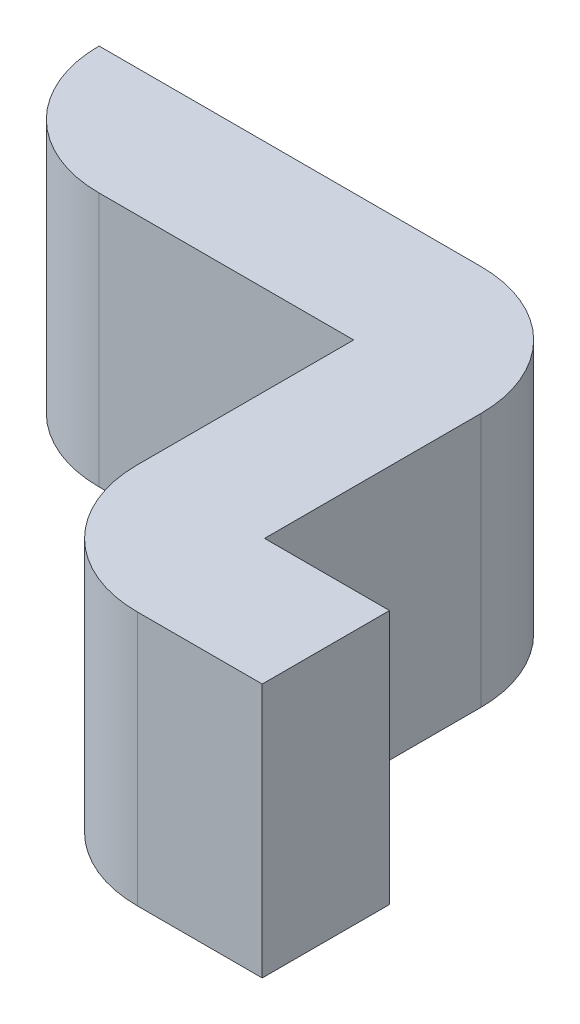
ISO-10303-21;
HEADER;
FILE_DESCRIPTION(('STEP AP214'),'2;1');
FILE_NAME('part.step','',(''),(''),'','','');
FILE_SCHEMA(('AUTOMOTIVE_DESIGN { 1 0 10303 214 1 1 1 1 }'));
ENDSEC;
DATA;
#1=APPLICATION_CONTEXT('core data for automotive mechanical design processes');
#2=APPLICATION_PROTOCOL_DEFINITION('international standard','automotive_design',2000,#1);
#3=PRODUCT_CONTEXT('',#1,'mechanical');
#4=PRODUCT('Part','Part','',(#3));
#5=PRODUCT_RELATED_PRODUCT_CATEGORY('part','',(#4));
#6=PRODUCT_DEFINITION_FORMATION('','',#4);
#7=PRODUCT_DEFINITION_CONTEXT('part definition',#1,'design');
#8=PRODUCT_DEFINITION('design','',#6,#7);
#9=PRODUCT_DEFINITION_SHAPE('','',#8);
#10=(LENGTH_UNIT() NAMED_UNIT(*) SI_UNIT(.MILLI.,.METRE.));
#11=(NAMED_UNIT(*) PLANE_ANGLE_UNIT() SI_UNIT($,.RADIAN.));
#12=(NAMED_UNIT(*) SI_UNIT($,.STERADIAN.) SOLID_ANGLE_UNIT());
#13=UNCERTAINTY_MEASURE_WITH_UNIT(LENGTH_MEASURE(1.E-05),#10,'distance_accuracy_value','');
#14=(GEOMETRIC_REPRESENTATION_CONTEXT(3) GLOBAL_UNCERTAINTY_ASSIGNED_CONTEXT((#13)) GLOBAL_UNIT_ASSIGNED_CONTEXT((#10,
#11,#12)) REPRESENTATION_CONTEXT('',''));
#15=CARTESIAN_POINT('',(0.,0.,0.));
#16=DIRECTION('',(0.,0.,1.));
#17=DIRECTION('',(1.,0.,0.));
#18=AXIS2_PLACEMENT_3D('',#15,#16,#17);
#19=CARTESIAN_POINT('',(0.8763,-1.0922,0.));
#20=DIRECTION('',(0.,-1.,0.));
#21=DIRECTION('',(0.,0.,-1.));
#22=AXIS2_PLACEMENT_3D('',#19,#20,#21);
#23=PLANE('',#22);
#24=DIRECTION('',(-1.,0.,0.));
#25=VECTOR('',#24,1.);
#26=CARTESIAN_POINT('',(1.0033,-1.0922,0.127));
#27=LINE('',#26,#25);
#28=CARTESIAN_POINT('',(1.0033,-1.0922,0.127));
#29=VERTEX_POINT('',#28);
#30=CARTESIAN_POINT('',(1.2573,-1.0922,0.127));
#31=VERTEX_POINT('',#30);
#32=EDGE_CURVE('E102',#29,#31,#27,.F.);
#33=ORIENTED_EDGE('',*,*,#32,.T.);
#34=DIRECTION('',(0.,0.,-1.));
#35=VECTOR('',#34,1.);
#36=CARTESIAN_POINT('',(1.2573,-1.0922,0.127));
#37=LINE('',#36,#35);
#38=CARTESIAN_POINT('',(1.2573,-1.0922,0.3429));
#39=VERTEX_POINT('',#38);
#40=EDGE_CURVE('E105',#31,#39,#37,.F.);
#41=ORIENTED_EDGE('',*,*,#40,.T.);
#42=CARTESIAN_POINT('',(1.3843,-1.0922,0.3429));
#43=DIRECTION('',(0.,-1.,0.));
#44=DIRECTION('',(0.,0.,-1.));
#45=AXIS2_PLACEMENT_3D('',#42,#43,#44);
#46=CIRCLE('',#45,0.127);
#47=CARTESIAN_POINT('',(1.3843,-1.0922,0.4699));
#48=VERTEX_POINT('',#47);
#49=EDGE_CURVE('E117',#48,#39,#46,.T.);
#50=ORIENTED_EDGE('',*,*,#49,.F.);
#51=DIRECTION('',(-1.,0.,0.));
#52=VECTOR('',#51,1.);
#53=CARTESIAN_POINT('',(1.3843,-1.0922,0.4699));
#54=LINE('',#53,#52);
#55=CARTESIAN_POINT('',(1.509,-1.0922,0.4699));
#56=VERTEX_POINT('',#55);
#57=EDGE_CURVE('E134',#48,#56,#54,.F.);
#58=ORIENTED_EDGE('',*,*,#57,.T.);
#59=DIRECTION('',(0.,0.,1.));
#60=VECTOR('',#59,1.);
#61=CARTESIAN_POINT('',(1.509,-1.0922,0.4699));
#62=LINE('',#61,#60);
#63=CARTESIAN_POINT('',(1.509,-1.0922,0.3429));
#64=VERTEX_POINT('',#63);
#65=EDGE_CURVE('E90',#56,#64,#62,.F.);
#66=ORIENTED_EDGE('',*,*,#65,.T.);
#67=DIRECTION('',(1.,0.,0.));
#68=VECTOR('',#67,1.);
#69=CARTESIAN_POINT('',(1.509,-1.0922,0.3429));
#70=LINE('',#69,#68);
#71=CARTESIAN_POINT('',(1.3843,-1.0922,0.3429));
#72=VERTEX_POINT('',#71);
#73=EDGE_CURVE('E87',#64,#72,#70,.F.);
#74=ORIENTED_EDGE('',*,*,#73,.T.);
#75=DIRECTION('',(0.,0.,1.));
#76=VECTOR('',#75,1.);
#77=CARTESIAN_POINT('',(1.3843,-1.0922,0.3429));
#78=LINE('',#77,#76);
#79=CARTESIAN_POINT('',(1.3843,-1.0922,0.127));
#80=VERTEX_POINT('',#79);
#81=EDGE_CURVE('E82',#72,#80,#78,.F.);
#82=ORIENTED_EDGE('',*,*,#81,.T.);
#83=CARTESIAN_POINT('',(1.2573,-1.0922,0.127));
#84=DIRECTION('',(0.,-1.,0.));
#85=DIRECTION('',(0.,0.,-1.));
#86=AXIS2_PLACEMENT_3D('',#83,#84,#85);
#87=CIRCLE('',#86,0.127);
#88=CARTESIAN_POINT('',(1.2573,-1.0922,0.));
#89=VERTEX_POINT('',#88);
#90=EDGE_CURVE('E20',#89,#80,#87,.T.);
#91=ORIENTED_EDGE('',*,*,#90,.F.);
#92=DIRECTION('',(1.,0.,0.));
#93=VECTOR('',#92,1.);
#94=CARTESIAN_POINT('',(1.2573,-1.0922,0.));
#95=LINE('',#94,#93);
#96=CARTESIAN_POINT('',(0.8763,-1.0922,0.));
#97=VERTEX_POINT('',#96);
#98=EDGE_CURVE('E76',#89,#97,#95,.F.);
#99=ORIENTED_EDGE('',*,*,#98,.T.);
#100=CARTESIAN_POINT('',(1.0033,-1.0922,0.));
#101=DIRECTION('',(0.,-1.,0.));
#102=DIRECTION('',(0.,0.,-1.));
#103=AXIS2_PLACEMENT_3D('',#100,#101,#102);
#104=CIRCLE('',#103,0.127);
#105=EDGE_CURVE('E108',#29,#97,#104,.T.);
#106=ORIENTED_EDGE('',*,*,#105,.F.);
#107=EDGE_LOOP('',(#33,#41,#50,#58,#66,#74,#82,#91,#99,#106));
#108=FACE_BOUND('',#107,.T.);
#109=ADVANCED_FACE('F17',(#108),#23,.F.);
#110=CARTESIAN_POINT('',(1.2573,-1.3462,0.));
#111=DIRECTION('',(0.,0.,1.));
#112=DIRECTION('',(1.,0.,0.));
#113=AXIS2_PLACEMENT_3D('',#110,#111,#112);
#114=PLANE('',#113);
#115=DIRECTION('',(0.,-1.,0.));
#116=VECTOR('',#115,1.);
#117=CARTESIAN_POINT('',(0.8763,-1.3462,0.));
#118=LINE('',#117,#116);
#119=CARTESIAN_POINT('',(0.8763,-1.3462,0.));
#120=VERTEX_POINT('',#119);
#121=EDGE_CURVE('E187',#97,#120,#118,.T.);
#122=ORIENTED_EDGE('',*,*,#121,.F.);
#123=ORIENTED_EDGE('',*,*,#98,.F.);
#124=DIRECTION('',(0.,-1.,0.));
#125=VECTOR('',#124,1.);
#126=CARTESIAN_POINT('',(1.2573,-1.3462,0.));
#127=LINE('',#126,#125);
#128=CARTESIAN_POINT('',(1.2573,-1.3462,0.));
#129=VERTEX_POINT('',#128);
#130=EDGE_CURVE('E159',#129,#89,#127,.F.);
#131=ORIENTED_EDGE('',*,*,#130,.F.);
#132=DIRECTION('',(1.,0.,0.));
#133=VECTOR('',#132,1.);
#134=CARTESIAN_POINT('',(0.8763,-1.3462,0.));
#135=LINE('',#134,#133);
#136=EDGE_CURVE('E186',#120,#129,#135,.T.);
#137=ORIENTED_EDGE('',*,*,#136,.F.);
#138=EDGE_LOOP('',(#122,#123,#131,#137));
#139=FACE_BOUND('',#138,.T.);
#140=ADVANCED_FACE('F217',(#139),#114,.F.);
#141=CARTESIAN_POINT('',(1.2573,-1.3462,0.127));
#142=DIRECTION('',(0.,-1.,0.));
#143=DIRECTION('',(0.,0.,-1.));
#144=AXIS2_PLACEMENT_3D('',#141,#142,#143);
#145=CYLINDRICAL_SURFACE('',#144,0.127);
#146=ORIENTED_EDGE('',*,*,#90,.T.);
#147=DIRECTION('',(0.,1.,0.));
#148=VECTOR('',#147,1.);
#149=CARTESIAN_POINT('',(1.3843,-1.3462,0.127));
#150=LINE('',#149,#148);
#151=CARTESIAN_POINT('',(1.3843,-1.3462,0.127));
#152=VERTEX_POINT('',#151);
#153=EDGE_CURVE('E157',#80,#152,#150,.F.);
#154=ORIENTED_EDGE('',*,*,#153,.T.);
#155=CARTESIAN_POINT('',(1.2573,-1.3462,0.127));
#156=DIRECTION('',(0.,-1.,0.));
#157=DIRECTION('',(0.,0.,-1.));
#158=AXIS2_PLACEMENT_3D('',#155,#156,#157);
#159=CIRCLE('',#158,0.127);
#160=EDGE_CURVE('E183',#129,#152,#159,.T.);
#161=ORIENTED_EDGE('',*,*,#160,.F.);
#162=ORIENTED_EDGE('',*,*,#130,.T.);
#163=EDGE_LOOP('',(#146,#154,#161,#162));
#164=FACE_BOUND('',#163,.T.);
#165=ADVANCED_FACE('F214',(#164),#145,.T.);
#166=CARTESIAN_POINT('',(1.3843,-1.3462,0.3429));
#167=DIRECTION('',(-1.,0.,0.));
#168=DIRECTION('',(0.,0.,1.));
#169=AXIS2_PLACEMENT_3D('',#166,#167,#168);
#170=PLANE('',#169);
#171=ORIENTED_EDGE('',*,*,#153,.F.);
#172=ORIENTED_EDGE('',*,*,#81,.F.);
#173=DIRECTION('',(0.,1.,0.));
#174=VECTOR('',#173,1.);
#175=CARTESIAN_POINT('',(1.3843,-1.3462,0.3429));
#176=LINE('',#175,#174);
#177=CARTESIAN_POINT('',(1.3843,-1.3462,0.3429));
#178=VERTEX_POINT('',#177);
#179=EDGE_CURVE('E153',#72,#178,#176,.F.);
#180=ORIENTED_EDGE('',*,*,#179,.T.);
#181=DIRECTION('',(0.,0.,-1.));
#182=VECTOR('',#181,1.);
#183=CARTESIAN_POINT('',(1.3843,-1.3462,0.));
#184=LINE('',#183,#182);
#185=EDGE_CURVE('E150',#152,#178,#184,.F.);
#186=ORIENTED_EDGE('',*,*,#185,.F.);
#187=EDGE_LOOP('',(#171,#172,#180,#186));
#188=FACE_BOUND('',#187,.T.);
#189=ADVANCED_FACE('F211',(#188),#170,.F.);
#190=CARTESIAN_POINT('',(1.509,-1.3462,0.3429));
#191=DIRECTION('',(0.,0.,1.));
#192=DIRECTION('',(1.,0.,0.));
#193=AXIS2_PLACEMENT_3D('',#190,#191,#192);
#194=PLANE('',#193);
#195=ORIENTED_EDGE('',*,*,#179,.F.);
#196=ORIENTED_EDGE('',*,*,#73,.F.);
#197=DIRECTION('',(0.,1.,0.));
#198=VECTOR('',#197,1.);
#199=CARTESIAN_POINT('',(1.509,-1.3462,0.3429));
#200=LINE('',#199,#198);
#201=CARTESIAN_POINT('',(1.509,-1.3462,0.3429));
#202=VERTEX_POINT('',#201);
#203=EDGE_CURVE('E144',#64,#202,#200,.F.);
#204=ORIENTED_EDGE('',*,*,#203,.T.);
#205=DIRECTION('',(1.,0.,0.));
#206=VECTOR('',#205,1.);
#207=CARTESIAN_POINT('',(0.8763,-1.3462,0.3429));
#208=LINE('',#207,#206);
#209=EDGE_CURVE('E141',#178,#202,#208,.T.);
#210=ORIENTED_EDGE('',*,*,#209,.F.);
#211=EDGE_LOOP('',(#195,#196,#204,#210));
#212=FACE_BOUND('',#211,.T.);
#213=ADVANCED_FACE('F208',(#212),#194,.F.);
#214=CARTESIAN_POINT('',(1.509,-1.3462,0.4699));
#215=DIRECTION('',(-1.,0.,0.));
#216=DIRECTION('',(0.,0.,1.));
#217=AXIS2_PLACEMENT_3D('',#214,#215,#216);
#218=PLANE('',#217);
#219=ORIENTED_EDGE('',*,*,#203,.F.);
#220=ORIENTED_EDGE('',*,*,#65,.F.);
#221=DIRECTION('',(0.,1.,0.));
#222=VECTOR('',#221,1.);
#223=CARTESIAN_POINT('',(1.509,-1.3462,0.4699));
#224=LINE('',#223,#222);
#225=CARTESIAN_POINT('',(1.509,-1.3462,0.4699));
#226=VERTEX_POINT('',#225);
#227=EDGE_CURVE('E132',#56,#226,#224,.F.);
#228=ORIENTED_EDGE('',*,*,#227,.T.);
#229=DIRECTION('',(0.,0.,-1.));
#230=VECTOR('',#229,1.);
#231=CARTESIAN_POINT('',(1.509,-1.3462,0.));
#232=LINE('',#231,#230);
#233=EDGE_CURVE('E137',#202,#226,#232,.F.);
#234=ORIENTED_EDGE('',*,*,#233,.F.);
#235=EDGE_LOOP('',(#219,#220,#228,#234));
#236=FACE_BOUND('',#235,.T.);
#237=ADVANCED_FACE('F195',(#236),#218,.F.);
#238=CARTESIAN_POINT('',(1.3843,-1.3462,0.4699));
#239=DIRECTION('',(0.,0.,-1.));
#240=DIRECTION('',(-1.,0.,0.));
#241=AXIS2_PLACEMENT_3D('',#238,#239,#240);
#242=PLANE('',#241);
#243=ORIENTED_EDGE('',*,*,#227,.F.);
#244=ORIENTED_EDGE('',*,*,#57,.F.);
#245=DIRECTION('',(0.,-1.,0.));
#246=VECTOR('',#245,1.);
#247=CARTESIAN_POINT('',(1.3843,-1.3462,0.4699));
#248=LINE('',#247,#246);
#249=CARTESIAN_POINT('',(1.3843,-1.3462,0.4699));
#250=VERTEX_POINT('',#249);
#251=EDGE_CURVE('E129',#250,#48,#248,.F.);
#252=ORIENTED_EDGE('',*,*,#251,.F.);
#253=DIRECTION('',(1.,0.,0.));
#254=VECTOR('',#253,1.);
#255=CARTESIAN_POINT('',(0.8763,-1.3462,0.4699));
#256=LINE('',#255,#254);
#257=EDGE_CURVE('E140',#226,#250,#256,.F.);
#258=ORIENTED_EDGE('',*,*,#257,.F.);
#259=EDGE_LOOP('',(#243,#244,#252,#258));
#260=FACE_BOUND('',#259,.T.);
#261=ADVANCED_FACE('F198',(#260),#242,.F.);
#262=CARTESIAN_POINT('',(1.3843,-1.3462,0.3429));
#263=DIRECTION('',(0.,-1.,0.));
#264=DIRECTION('',(0.,0.,-1.));
#265=AXIS2_PLACEMENT_3D('',#262,#263,#264);
#266=CYLINDRICAL_SURFACE('',#265,0.127);
#267=ORIENTED_EDGE('',*,*,#49,.T.);
#268=DIRECTION('',(0.,1.,0.));
#269=VECTOR('',#268,1.);
#270=CARTESIAN_POINT('',(1.2573,-1.3462,0.3429));
#271=LINE('',#270,#269);
#272=CARTESIAN_POINT('',(1.2573,-1.3462,0.3429));
#273=VERTEX_POINT('',#272);
#274=EDGE_CURVE('E111',#39,#273,#271,.F.);
#275=ORIENTED_EDGE('',*,*,#274,.T.);
#276=CARTESIAN_POINT('',(1.3843,-1.3462,0.3429));
#277=DIRECTION('',(0.,-1.,0.));
#278=DIRECTION('',(0.,0.,-1.));
#279=AXIS2_PLACEMENT_3D('',#276,#277,#278);
#280=CIRCLE('',#279,0.127);
#281=EDGE_CURVE('E179',#250,#273,#280,.T.);
#282=ORIENTED_EDGE('',*,*,#281,.F.);
#283=ORIENTED_EDGE('',*,*,#251,.T.);
#284=EDGE_LOOP('',(#267,#275,#282,#283));
#285=FACE_BOUND('',#284,.T.);
#286=ADVANCED_FACE('F189',(#285),#266,.T.);
#287=CARTESIAN_POINT('',(1.2573,-1.3462,0.127));
#288=DIRECTION('',(1.,0.,0.));
#289=DIRECTION('',(0.,0.,-1.));
#290=AXIS2_PLACEMENT_3D('',#287,#288,#289);
#291=PLANE('',#290);
#292=ORIENTED_EDGE('',*,*,#274,.F.);
#293=ORIENTED_EDGE('',*,*,#40,.F.);
#294=DIRECTION('',(0.,1.,0.));
#295=VECTOR('',#294,1.);
#296=CARTESIAN_POINT('',(1.2573,-1.3462,0.127));
#297=LINE('',#296,#295);
#298=CARTESIAN_POINT('',(1.2573,-1.3462,0.127));
#299=VERTEX_POINT('',#298);
#300=EDGE_CURVE('E110',#31,#299,#297,.F.);
#301=ORIENTED_EDGE('',*,*,#300,.T.);
#302=DIRECTION('',(0.,0.,-1.));
#303=VECTOR('',#302,1.);
#304=CARTESIAN_POINT('',(1.2573,-1.3462,0.));
#305=LINE('',#304,#303);
#306=EDGE_CURVE('E182',#273,#299,#305,.T.);
#307=ORIENTED_EDGE('',*,*,#306,.F.);
#308=EDGE_LOOP('',(#292,#293,#301,#307));
#309=FACE_BOUND('',#308,.T.);
#310=ADVANCED_FACE('F115',(#309),#291,.F.);
#311=CARTESIAN_POINT('',(1.0033,-1.3462,0.127));
#312=DIRECTION('',(0.,0.,-1.));
#313=DIRECTION('',(-1.,0.,0.));
#314=AXIS2_PLACEMENT_3D('',#311,#312,#313);
#315=PLANE('',#314);
#316=ORIENTED_EDGE('',*,*,#300,.F.);
#317=ORIENTED_EDGE('',*,*,#32,.F.);
#318=DIRECTION('',(0.,-1.,0.));
#319=VECTOR('',#318,1.);
#320=CARTESIAN_POINT('',(1.0033,-1.3462,0.127));
#321=LINE('',#320,#319);
#322=CARTESIAN_POINT('',(1.0033,-1.3462,0.127));
#323=VERTEX_POINT('',#322);
#324=EDGE_CURVE('E35',#323,#29,#321,.F.);
#325=ORIENTED_EDGE('',*,*,#324,.F.);
#326=DIRECTION('',(1.,0.,0.));
#327=VECTOR('',#326,1.);
#328=CARTESIAN_POINT('',(0.8763,-1.3462,0.127));
#329=LINE('',#328,#327);
#330=EDGE_CURVE('E26',#299,#323,#329,.F.);
#331=ORIENTED_EDGE('',*,*,#330,.F.);
#332=EDGE_LOOP('',(#316,#317,#325,#331));
#333=FACE_BOUND('',#332,.T.);
#334=ADVANCED_FACE('F119',(#333),#315,.F.);
#335=CARTESIAN_POINT('',(1.0033,-1.3462,0.));
#336=DIRECTION('',(0.,-1.,0.));
#337=DIRECTION('',(0.,0.,-1.));
#338=AXIS2_PLACEMENT_3D('',#335,#336,#337);
#339=CYLINDRICAL_SURFACE('',#338,0.127);
#340=ORIENTED_EDGE('',*,*,#105,.T.);
#341=ORIENTED_EDGE('',*,*,#121,.T.);
#342=CARTESIAN_POINT('',(1.0033,-1.3462,0.));
#343=DIRECTION('',(0.,-1.,0.));
#344=DIRECTION('',(0.,0.,-1.));
#345=AXIS2_PLACEMENT_3D('',#342,#343,#344);
#346=CIRCLE('',#345,0.127);
#347=EDGE_CURVE('E11',#323,#120,#346,.T.);
#348=ORIENTED_EDGE('',*,*,#347,.F.);
#349=ORIENTED_EDGE('',*,*,#324,.T.);
#350=EDGE_LOOP('',(#340,#341,#348,#349));
#351=FACE_BOUND('',#350,.T.);
#352=ADVANCED_FACE('F219',(#351),#339,.T.);
#353=CARTESIAN_POINT('',(0.8763,-1.3462,0.));
#354=DIRECTION('',(0.,-1.,0.));
#355=DIRECTION('',(0.,0.,-1.));
#356=AXIS2_PLACEMENT_3D('',#353,#354,#355);
#357=PLANE('',#356);
#358=ORIENTED_EDGE('',*,*,#330,.T.);
#359=ORIENTED_EDGE('',*,*,#347,.T.);
#360=ORIENTED_EDGE('',*,*,#136,.T.);
#361=ORIENTED_EDGE('',*,*,#160,.T.);
#362=ORIENTED_EDGE('',*,*,#185,.T.);
#363=ORIENTED_EDGE('',*,*,#209,.T.);
#364=ORIENTED_EDGE('',*,*,#233,.T.);
#365=ORIENTED_EDGE('',*,*,#257,.T.);
#366=ORIENTED_EDGE('',*,*,#281,.T.);
#367=ORIENTED_EDGE('',*,*,#306,.T.);
#368=EDGE_LOOP('',(#358,#359,#360,#361,#362,#363,#364,#365,#366,#367));
#369=FACE_BOUND('',#368,.T.);
#370=ADVANCED_FACE('F202',(#369),#357,.T.);
#371=CLOSED_SHELL('',(#109,#140,#165,#189,#213,#237,#261,#286,#310,#334,#352,#370));
#372=MANIFOLD_SOLID_BREP('B1',#371);
#373=ADVANCED_BREP_SHAPE_REPRESENTATION('',(#18,#372),#14);
#374=SHAPE_DEFINITION_REPRESENTATION(#9,#373);
ENDSEC;
END-ISO-10303-21;
